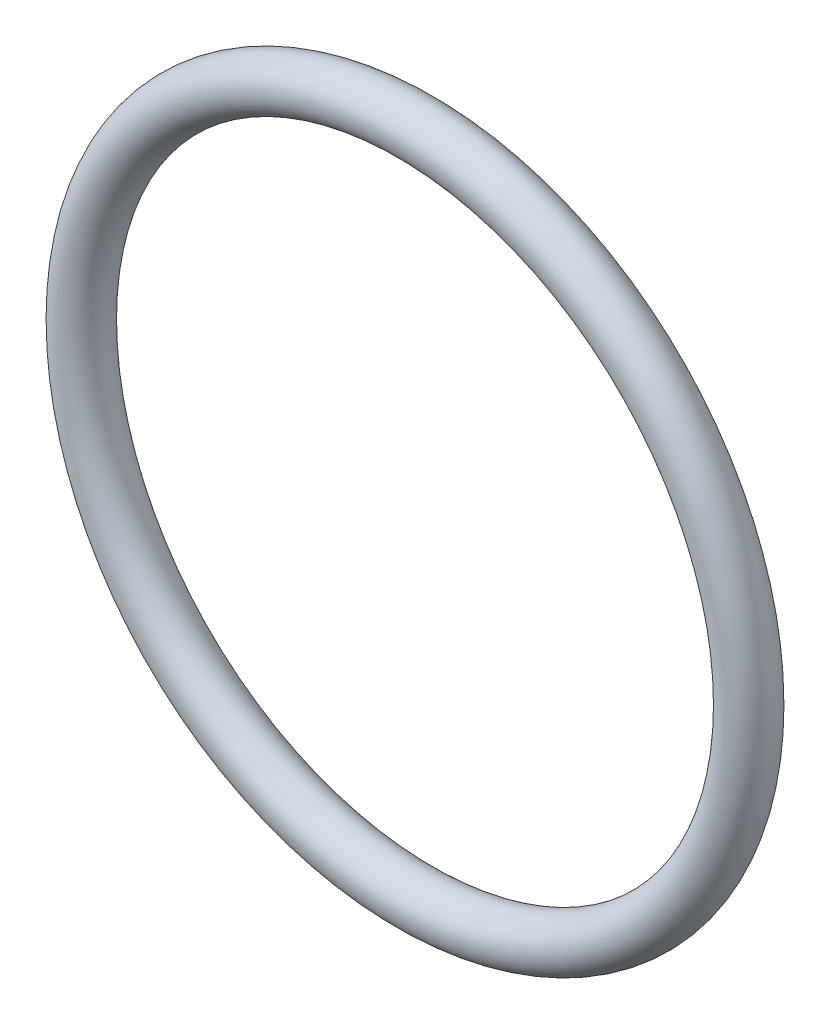
ISO-10303-21;
HEADER;
FILE_DESCRIPTION(('STEP AP214'),'2;1');
FILE_NAME('part.step','',(''),(''),'','','');
FILE_SCHEMA(('AUTOMOTIVE_DESIGN { 1 0 10303 214 1 1 1 1 }'));
ENDSEC;
DATA;
#1=APPLICATION_CONTEXT('core data for automotive mechanical design processes');
#2=APPLICATION_PROTOCOL_DEFINITION('international standard','automotive_design',2000,#1);
#3=PRODUCT_CONTEXT('',#1,'mechanical');
#4=PRODUCT('Part','Part','',(#3));
#5=PRODUCT_RELATED_PRODUCT_CATEGORY('part','',(#4));
#6=PRODUCT_DEFINITION_FORMATION('','',#4);
#7=PRODUCT_DEFINITION_CONTEXT('part definition',#1,'design');
#8=PRODUCT_DEFINITION('design','',#6,#7);
#9=PRODUCT_DEFINITION_SHAPE('','',#8);
#10=(LENGTH_UNIT() NAMED_UNIT(*) SI_UNIT(.MILLI.,.METRE.));
#11=(NAMED_UNIT(*) PLANE_ANGLE_UNIT() SI_UNIT($,.RADIAN.));
#12=(NAMED_UNIT(*) SI_UNIT($,.STERADIAN.) SOLID_ANGLE_UNIT());
#13=UNCERTAINTY_MEASURE_WITH_UNIT(LENGTH_MEASURE(1.E-05),#10,'distance_accuracy_value','');
#14=(GEOMETRIC_REPRESENTATION_CONTEXT(3) GLOBAL_UNCERTAINTY_ASSIGNED_CONTEXT((#13)) GLOBAL_UNIT_ASSIGNED_CONTEXT((#10,
#11,#12)) REPRESENTATION_CONTEXT('',''));
#15=CARTESIAN_POINT('',(0.,0.,0.));
#16=DIRECTION('',(0.,0.,1.));
#17=DIRECTION('',(1.,0.,0.));
#18=AXIS2_PLACEMENT_3D('',#15,#16,#17);
#19=CARTESIAN_POINT('',(0.,0.,0.));
#20=DIRECTION('',(0.,0.,-1.));
#21=DIRECTION('',(-1.,0.,0.));
#22=AXIS2_PLACEMENT_3D('',#19,#20,#21);
#23=TOROIDAL_SURFACE('',#22,38.15,2.85);
#24=CARTESIAN_POINT('',(-41.,0.,0.));
#25=VERTEX_POINT('',#24);
#26=VERTEX_LOOP('',#25);
#27=FACE_BOUND('',#26,.T.);
#28=ADVANCED_FACE('F29',(#27),#23,.T.);
#29=CLOSED_SHELL('',(#28));
#30=MANIFOLD_SOLID_BREP('B2',#29);
#31=ADVANCED_BREP_SHAPE_REPRESENTATION('',(#18,#30),#14);
#32=SHAPE_DEFINITION_REPRESENTATION(#9,#31);
ENDSEC;
END-ISO-10303-21;
